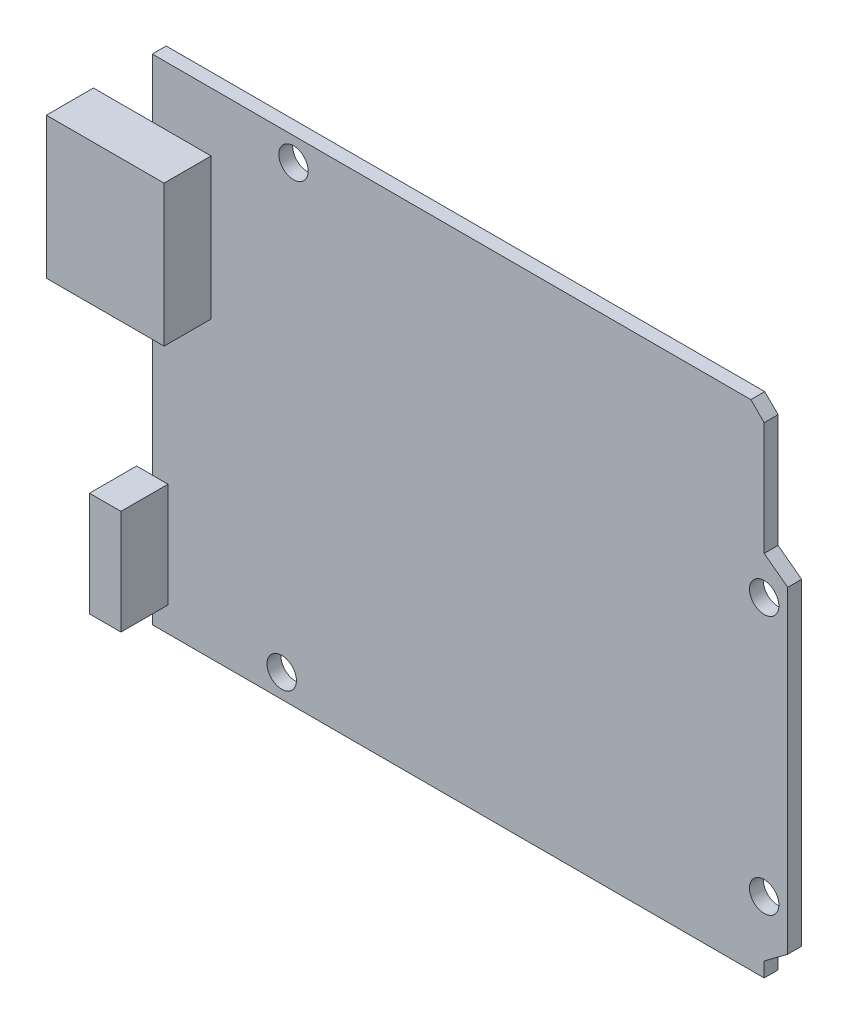
ISO-10303-21;
HEADER;
FILE_DESCRIPTION(('STEP AP214'),'2;1');
FILE_NAME('part.step','',(''),(''),'','','');
FILE_SCHEMA(('AUTOMOTIVE_DESIGN { 1 0 10303 214 1 1 1 1 }'));
ENDSEC;
DATA;
#1=APPLICATION_CONTEXT('core data for automotive mechanical design processes');
#2=APPLICATION_PROTOCOL_DEFINITION('international standard','automotive_design',2000,#1);
#3=PRODUCT_CONTEXT('',#1,'mechanical');
#4=PRODUCT('Part','Part','',(#3));
#5=PRODUCT_RELATED_PRODUCT_CATEGORY('part','',(#4));
#6=PRODUCT_DEFINITION_FORMATION('','',#4);
#7=PRODUCT_DEFINITION_CONTEXT('part definition',#1,'design');
#8=PRODUCT_DEFINITION('design','',#6,#7);
#9=PRODUCT_DEFINITION_SHAPE('','',#8);
#10=(LENGTH_UNIT() NAMED_UNIT(*) SI_UNIT(.MILLI.,.METRE.));
#11=(NAMED_UNIT(*) PLANE_ANGLE_UNIT() SI_UNIT($,.RADIAN.));
#12=(NAMED_UNIT(*) SI_UNIT($,.STERADIAN.) SOLID_ANGLE_UNIT());
#13=UNCERTAINTY_MEASURE_WITH_UNIT(LENGTH_MEASURE(1.E-05),#10,'distance_accuracy_value','');
#14=(GEOMETRIC_REPRESENTATION_CONTEXT(3) GLOBAL_UNCERTAINTY_ASSIGNED_CONTEXT((#13)) GLOBAL_UNIT_ASSIGNED_CONTEXT((#10,
#11,#12)) REPRESENTATION_CONTEXT('',''));
#15=CARTESIAN_POINT('',(0.,0.,0.));
#16=DIRECTION('',(0.,0.,1.));
#17=DIRECTION('',(1.,0.,0.));
#18=AXIS2_PLACEMENT_3D('',#15,#16,#17);
#19=CARTESIAN_POINT('',(0.,0.,1.5));
#20=DIRECTION('',(0.,0.,-1.));
#21=DIRECTION('',(-1.,0.,0.));
#22=AXIS2_PLACEMENT_3D('',#19,#20,#21);
#23=PLANE('',#22);
#24=CARTESIAN_POINT('',(-19.05,24.13,1.5));
#25=DIRECTION('',(0.,0.,1.));
#26=DIRECTION('',(1.,0.,0.));
#27=AXIS2_PLACEMENT_3D('',#24,#25,#26);
#28=CIRCLE('',#27,1.5875);
#29=CARTESIAN_POINT('',(-17.4625,24.13,1.5));
#30=VERTEX_POINT('',#29);
#31=EDGE_CURVE('E214',#30,#30,#28,.T.);
#32=ORIENTED_EDGE('',*,*,#31,.F.);
#33=EDGE_LOOP('',(#32));
#34=FACE_BOUND('',#33,.T.);
#35=CARTESIAN_POINT('',(31.75,-19.05,1.5));
#36=DIRECTION('',(0.,0.,1.));
#37=DIRECTION('',(1.,0.,0.));
#38=AXIS2_PLACEMENT_3D('',#35,#36,#37);
#39=CIRCLE('',#38,1.5875);
#40=CARTESIAN_POINT('',(33.3375,-19.05,1.5));
#41=VERTEX_POINT('',#40);
#42=EDGE_CURVE('E317',#41,#41,#39,.T.);
#43=ORIENTED_EDGE('',*,*,#42,.F.);
#44=EDGE_LOOP('',(#43));
#45=FACE_BOUND('',#44,.T.);
#46=CARTESIAN_POINT('',(31.75,8.89,1.5));
#47=DIRECTION('',(0.,0.,1.));
#48=DIRECTION('',(1.,0.,0.));
#49=AXIS2_PLACEMENT_3D('',#46,#47,#48);
#50=CIRCLE('',#49,1.5875);
#51=CARTESIAN_POINT('',(33.3375,8.89,1.5));
#52=VERTEX_POINT('',#51);
#53=EDGE_CURVE('E320',#52,#52,#50,.T.);
#54=ORIENTED_EDGE('',*,*,#53,.F.);
#55=EDGE_LOOP('',(#54));
#56=FACE_BOUND('',#55,.T.);
#57=CARTESIAN_POINT('',(-20.32,-24.13,1.5));
#58=DIRECTION('',(0.,0.,1.));
#59=DIRECTION('',(1.,0.,0.));
#60=AXIS2_PLACEMENT_3D('',#57,#58,#59);
#61=CIRCLE('',#60,1.5875);
#62=CARTESIAN_POINT('',(-18.7325,-24.13,1.5));
#63=VERTEX_POINT('',#62);
#64=EDGE_CURVE('E316',#63,#63,#61,.T.);
#65=ORIENTED_EDGE('',*,*,#64,.F.);
#66=EDGE_LOOP('',(#65));
#67=FACE_BOUND('',#66,.T.);
#68=DIRECTION('',(0.,1.,0.));
#69=VECTOR('',#68,1.);
#70=CARTESIAN_POINT('',(34.29,-26.67,1.5));
#71=LINE('',#70,#69);
#72=CARTESIAN_POINT('',(34.29,-23.1815470961268,1.5));
#73=VERTEX_POINT('',#72);
#74=CARTESIAN_POINT('',(34.29,11.1157964472055,1.5));
#75=VERTEX_POINT('',#74);
#76=EDGE_CURVE('E204',#73,#75,#71,.T.);
#77=ORIENTED_EDGE('',*,*,#76,.T.);
#78=DIRECTION('',(0.801223892096283,-0.598364667016765,0.));
#79=VECTOR('',#78,1.);
#80=CARTESIAN_POINT('',(31.75,13.0127022549518,1.5));
#81=LINE('',#80,#79);
#82=CARTESIAN_POINT('',(31.75,13.0127022549518,1.5));
#83=VERTEX_POINT('',#82);
#84=EDGE_CURVE('E176',#83,#75,#81,.T.);
#85=ORIENTED_EDGE('',*,*,#84,.F.);
#86=DIRECTION('',(0.,-1.,0.));
#87=VECTOR('',#86,1.);
#88=CARTESIAN_POINT('',(31.75,13.0127022549518,1.5));
#89=LINE('',#88,#87);
#90=CARTESIAN_POINT('',(31.75,25.2331590206289,1.5));
#91=VERTEX_POINT('',#90);
#92=EDGE_CURVE('E306',#91,#83,#89,.T.);
#93=ORIENTED_EDGE('',*,*,#92,.F.);
#94=DIRECTION('',(0.707106781186552,-0.707106781186543,0.));
#95=VECTOR('',#94,1.);
#96=CARTESIAN_POINT('',(30.3131590206289,26.67,1.5));
#97=LINE('',#96,#95);
#98=CARTESIAN_POINT('',(30.3131590206289,26.67,1.5));
#99=VERTEX_POINT('',#98);
#100=EDGE_CURVE('E303',#99,#91,#97,.T.);
#101=ORIENTED_EDGE('',*,*,#100,.F.);
#102=DIRECTION('',(-1.,0.,0.));
#103=VECTOR('',#102,1.);
#104=CARTESIAN_POINT('',(-34.29,26.67,1.5));
#105=LINE('',#104,#103);
#106=CARTESIAN_POINT('',(-34.29,26.67,1.5));
#107=VERTEX_POINT('',#106);
#108=EDGE_CURVE('E184',#99,#107,#105,.T.);
#109=ORIENTED_EDGE('',*,*,#108,.T.);
#110=DIRECTION('',(0.,-1.,0.));
#111=VECTOR('',#110,1.);
#112=CARTESIAN_POINT('',(-34.29,-26.67,1.5));
#113=LINE('',#112,#111);
#114=CARTESIAN_POINT('',(-34.29,20.32,1.5));
#115=VERTEX_POINT('',#114);
#116=EDGE_CURVE('E289',#107,#115,#113,.T.);
#117=ORIENTED_EDGE('',*,*,#116,.T.);
#118=DIRECTION('',(-1.,0.,0.));
#119=VECTOR('',#118,1.);
#120=CARTESIAN_POINT('',(-40.64,20.32,1.5));
#121=LINE('',#120,#119);
#122=CARTESIAN_POINT('',(-27.94,20.32,1.5));
#123=VERTEX_POINT('',#122);
#124=EDGE_CURVE('E269',#123,#115,#121,.T.);
#125=ORIENTED_EDGE('',*,*,#124,.F.);
#126=DIRECTION('',(0.,1.,0.));
#127=VECTOR('',#126,1.);
#128=CARTESIAN_POINT('',(-27.94,5.08,1.5));
#129=LINE('',#128,#127);
#130=CARTESIAN_POINT('',(-27.94,5.08,1.5));
#131=VERTEX_POINT('',#130);
#132=EDGE_CURVE('E255',#131,#123,#129,.T.);
#133=ORIENTED_EDGE('',*,*,#132,.F.);
#134=DIRECTION('',(1.,0.,0.));
#135=VECTOR('',#134,1.);
#136=CARTESIAN_POINT('',(-40.64,5.08,1.5));
#137=LINE('',#136,#135);
#138=CARTESIAN_POINT('',(-34.29,5.08,1.5));
#139=VERTEX_POINT('',#138);
#140=EDGE_CURVE('E11',#139,#131,#137,.T.);
#141=ORIENTED_EDGE('',*,*,#140,.F.);
#142=CARTESIAN_POINT('',(-34.29,-12.6860049869124,1.5));
#143=VERTEX_POINT('',#142);
#144=EDGE_CURVE('E356',#139,#143,#113,.T.);
#145=ORIENTED_EDGE('',*,*,#144,.T.);
#146=DIRECTION('',(-1.,0.,0.));
#147=VECTOR('',#146,1.);
#148=CARTESIAN_POINT('',(-35.9875181952427,-12.6860049869124,1.5));
#149=LINE('',#148,#147);
#150=CARTESIAN_POINT('',(-32.5924818047572,-12.6860049869124,1.5));
#151=VERTEX_POINT('',#150);
#152=EDGE_CURVE('E230',#151,#143,#149,.T.);
#153=ORIENTED_EDGE('',*,*,#152,.F.);
#154=DIRECTION('',(0.,1.,0.));
#155=VECTOR('',#154,1.);
#156=CARTESIAN_POINT('',(-32.5924818047572,-23.9715545871231,1.5));
#157=LINE('',#156,#155);
#158=CARTESIAN_POINT('',(-32.5924818047572,-23.9715545871231,1.5));
#159=VERTEX_POINT('',#158);
#160=EDGE_CURVE('E221',#159,#151,#157,.T.);
#161=ORIENTED_EDGE('',*,*,#160,.F.);
#162=DIRECTION('',(1.,0.,0.));
#163=VECTOR('',#162,1.);
#164=CARTESIAN_POINT('',(-35.9875181952427,-23.9715545871231,1.5));
#165=LINE('',#164,#163);
#166=CARTESIAN_POINT('',(-34.29,-23.9715545871231,1.5));
#167=VERTEX_POINT('',#166);
#168=EDGE_CURVE('E239',#167,#159,#165,.T.);
#169=ORIENTED_EDGE('',*,*,#168,.F.);
#170=CARTESIAN_POINT('',(-34.29,-26.67,1.5));
#171=VERTEX_POINT('',#170);
#172=EDGE_CURVE('E288',#167,#171,#113,.T.);
#173=ORIENTED_EDGE('',*,*,#172,.T.);
#174=DIRECTION('',(1.,0.,0.));
#175=VECTOR('',#174,1.);
#176=CARTESIAN_POINT('',(-34.29,-26.67,1.5));
#177=LINE('',#176,#175);
#178=CARTESIAN_POINT('',(31.75,-26.67,1.5));
#179=VERTEX_POINT('',#178);
#180=EDGE_CURVE('E208',#171,#179,#177,.T.);
#181=ORIENTED_EDGE('',*,*,#180,.T.);
#182=DIRECTION('',(0.,-1.,0.));
#183=VECTOR('',#182,1.);
#184=CARTESIAN_POINT('',(31.75,-25.0784529038732,1.5));
#185=LINE('',#184,#183);
#186=CARTESIAN_POINT('',(31.75,-25.0784529038732,1.5));
#187=VERTEX_POINT('',#186);
#188=EDGE_CURVE('E296',#187,#179,#185,.T.);
#189=ORIENTED_EDGE('',*,*,#188,.F.);
#190=DIRECTION('',(-0.801223892096282,-0.598364667016766,0.));
#191=VECTOR('',#190,1.);
#192=CARTESIAN_POINT('',(34.29,-23.1815470961268,1.5));
#193=LINE('',#192,#191);
#194=EDGE_CURVE('E617',#73,#187,#193,.T.);
#195=ORIENTED_EDGE('',*,*,#194,.F.);
#196=EDGE_LOOP('',(#77,#85,#93,#101,#109,#117,#125,#133,#141,#145,#153,#161,#169,#173,#181,#189,#195));
#197=FACE_BOUND('',#196,.T.);
#198=ADVANCED_FACE('F34',(#34,#45,#56,#67,#197),#23,.F.);
#199=CARTESIAN_POINT('',(34.29,-26.67,1.5));
#200=DIRECTION('',(-1.,0.,0.));
#201=DIRECTION('',(0.,0.,1.));
#202=AXIS2_PLACEMENT_3D('',#199,#200,#201);
#203=PLANE('',#202);
#204=DIRECTION('',(0.,1.,0.));
#205=VECTOR('',#204,1.);
#206=CARTESIAN_POINT('',(34.29,-26.67,0.));
#207=LINE('',#206,#205);
#208=CARTESIAN_POINT('',(34.29,-23.1815470961268,0.));
#209=VERTEX_POINT('',#208);
#210=CARTESIAN_POINT('',(34.29,11.1157964472055,0.));
#211=VERTEX_POINT('',#210);
#212=EDGE_CURVE('E193',#209,#211,#207,.T.);
#213=ORIENTED_EDGE('',*,*,#212,.T.);
#214=DIRECTION('',(0.,0.,1.));
#215=VECTOR('',#214,1.);
#216=CARTESIAN_POINT('',(34.29,11.1157964472055,0.));
#217=LINE('',#216,#215);
#218=EDGE_CURVE('E321',#211,#75,#217,.T.);
#219=ORIENTED_EDGE('',*,*,#218,.T.);
#220=ORIENTED_EDGE('',*,*,#76,.F.);
#221=DIRECTION('',(0.,0.,1.));
#222=VECTOR('',#221,1.);
#223=CARTESIAN_POINT('',(34.29,-23.1815470961268,0.));
#224=LINE('',#223,#222);
#225=EDGE_CURVE('E308',#209,#73,#224,.T.);
#226=ORIENTED_EDGE('',*,*,#225,.F.);
#227=EDGE_LOOP('',(#213,#219,#220,#226));
#228=FACE_BOUND('',#227,.T.);
#229=ADVANCED_FACE('F36',(#228),#203,.F.);
#230=CARTESIAN_POINT('',(-34.29,26.67,1.5));
#231=DIRECTION('',(0.,-1.,0.));
#232=DIRECTION('',(0.,0.,-1.));
#233=AXIS2_PLACEMENT_3D('',#230,#231,#232);
#234=PLANE('',#233);
#235=ORIENTED_EDGE('',*,*,#108,.F.);
#236=DIRECTION('',(0.,0.,1.));
#237=VECTOR('',#236,1.);
#238=CARTESIAN_POINT('',(30.3131590206289,26.67,0.));
#239=LINE('',#238,#237);
#240=CARTESIAN_POINT('',(30.3131590206289,26.67,0.));
#241=VERTEX_POINT('',#240);
#242=EDGE_CURVE('E171',#241,#99,#239,.T.);
#243=ORIENTED_EDGE('',*,*,#242,.F.);
#244=DIRECTION('',(-1.,0.,0.));
#245=VECTOR('',#244,1.);
#246=CARTESIAN_POINT('',(-34.29,26.67,0.));
#247=LINE('',#246,#245);
#248=CARTESIAN_POINT('',(-34.29,26.67,0.));
#249=VERTEX_POINT('',#248);
#250=EDGE_CURVE('E182',#241,#249,#247,.T.);
#251=ORIENTED_EDGE('',*,*,#250,.T.);
#252=DIRECTION('',(0.,0.,-1.));
#253=VECTOR('',#252,1.);
#254=CARTESIAN_POINT('',(-34.29,26.67,1.5));
#255=LINE('',#254,#253);
#256=EDGE_CURVE('E43',#107,#249,#255,.T.);
#257=ORIENTED_EDGE('',*,*,#256,.F.);
#258=EDGE_LOOP('',(#235,#243,#251,#257));
#259=FACE_BOUND('',#258,.T.);
#260=ADVANCED_FACE('F180',(#259),#234,.F.);
#261=CARTESIAN_POINT('',(-34.29,-26.67,1.5));
#262=DIRECTION('',(1.,0.,0.));
#263=DIRECTION('',(0.,0.,-1.));
#264=AXIS2_PLACEMENT_3D('',#261,#262,#263);
#265=PLANE('',#264);
#266=DIRECTION('',(0.,-1.,0.));
#267=VECTOR('',#266,1.);
#268=CARTESIAN_POINT('',(-34.29,-26.67,0.));
#269=LINE('',#268,#267);
#270=CARTESIAN_POINT('',(-34.29,-26.67,0.));
#271=VERTEX_POINT('',#270);
#272=EDGE_CURVE('E192',#249,#271,#269,.T.);
#273=ORIENTED_EDGE('',*,*,#272,.T.);
#274=DIRECTION('',(0.,0.,-1.));
#275=VECTOR('',#274,1.);
#276=CARTESIAN_POINT('',(-34.29,-26.67,1.5));
#277=LINE('',#276,#275);
#278=EDGE_CURVE('E205',#171,#271,#277,.T.);
#279=ORIENTED_EDGE('',*,*,#278,.F.);
#280=ORIENTED_EDGE('',*,*,#172,.F.);
#281=EDGE_CURVE('E352',#143,#167,#113,.T.);
#282=ORIENTED_EDGE('',*,*,#281,.F.);
#283=ORIENTED_EDGE('',*,*,#144,.F.);
#284=EDGE_CURVE('E290',#115,#139,#113,.T.);
#285=ORIENTED_EDGE('',*,*,#284,.F.);
#286=ORIENTED_EDGE('',*,*,#116,.F.);
#287=ORIENTED_EDGE('',*,*,#256,.T.);
#288=EDGE_LOOP('',(#273,#279,#280,#282,#283,#285,#286,#287));
#289=FACE_BOUND('',#288,.T.);
#290=ADVANCED_FACE('F377',(#289),#265,.F.);
#291=CARTESIAN_POINT('',(-34.29,-26.67,1.5));
#292=DIRECTION('',(0.,1.,0.));
#293=DIRECTION('',(0.,0.,1.));
#294=AXIS2_PLACEMENT_3D('',#291,#292,#293);
#295=PLANE('',#294);
#296=DIRECTION('',(1.,0.,0.));
#297=VECTOR('',#296,1.);
#298=CARTESIAN_POINT('',(-34.29,-26.67,0.));
#299=LINE('',#298,#297);
#300=CARTESIAN_POINT('',(31.75,-26.67,0.));
#301=VERTEX_POINT('',#300);
#302=EDGE_CURVE('E195',#271,#301,#299,.T.);
#303=ORIENTED_EDGE('',*,*,#302,.T.);
#304=DIRECTION('',(0.,0.,1.));
#305=VECTOR('',#304,1.);
#306=CARTESIAN_POINT('',(31.75,-26.67,0.));
#307=LINE('',#306,#305);
#308=EDGE_CURVE('E302',#301,#179,#307,.T.);
#309=ORIENTED_EDGE('',*,*,#308,.T.);
#310=ORIENTED_EDGE('',*,*,#180,.F.);
#311=ORIENTED_EDGE('',*,*,#278,.T.);
#312=EDGE_LOOP('',(#303,#309,#310,#311));
#313=FACE_BOUND('',#312,.T.);
#314=ADVANCED_FACE('F301',(#313),#295,.F.);
#315=CARTESIAN_POINT('',(0.,0.,0.));
#316=DIRECTION('',(0.,0.,-1.));
#317=DIRECTION('',(-1.,0.,0.));
#318=AXIS2_PLACEMENT_3D('',#315,#316,#317);
#319=PLANE('',#318);
#320=DIRECTION('',(0.801223892096283,-0.598364667016765,0.));
#321=VECTOR('',#320,1.);
#322=CARTESIAN_POINT('',(31.75,13.0127022549518,0.));
#323=LINE('',#322,#321);
#324=CARTESIAN_POINT('',(31.75,13.0127022549518,0.));
#325=VERTEX_POINT('',#324);
#326=EDGE_CURVE('E185',#325,#211,#323,.T.);
#327=ORIENTED_EDGE('',*,*,#326,.T.);
#328=ORIENTED_EDGE('',*,*,#212,.F.);
#329=DIRECTION('',(-0.801223892096282,-0.598364667016766,0.));
#330=VECTOR('',#329,1.);
#331=CARTESIAN_POINT('',(34.29,-23.1815470961268,0.));
#332=LINE('',#331,#330);
#333=CARTESIAN_POINT('',(31.75,-25.0784529038732,0.));
#334=VERTEX_POINT('',#333);
#335=EDGE_CURVE('E614',#209,#334,#332,.T.);
#336=ORIENTED_EDGE('',*,*,#335,.T.);
#337=DIRECTION('',(0.,-1.,0.));
#338=VECTOR('',#337,1.);
#339=CARTESIAN_POINT('',(31.75,-25.0784529038732,0.));
#340=LINE('',#339,#338);
#341=EDGE_CURVE('E60',#334,#301,#340,.T.);
#342=ORIENTED_EDGE('',*,*,#341,.T.);
#343=ORIENTED_EDGE('',*,*,#302,.F.);
#344=ORIENTED_EDGE('',*,*,#272,.F.);
#345=ORIENTED_EDGE('',*,*,#250,.F.);
#346=DIRECTION('',(0.707106781186552,-0.707106781186543,0.));
#347=VECTOR('',#346,1.);
#348=CARTESIAN_POINT('',(30.3131590206289,26.67,0.));
#349=LINE('',#348,#347);
#350=CARTESIAN_POINT('',(31.75,25.2331590206289,0.));
#351=VERTEX_POINT('',#350);
#352=EDGE_CURVE('E167',#241,#351,#349,.T.);
#353=ORIENTED_EDGE('',*,*,#352,.T.);
#354=DIRECTION('',(0.,-1.,0.));
#355=VECTOR('',#354,1.);
#356=CARTESIAN_POINT('',(31.75,13.0127022549518,0.));
#357=LINE('',#356,#355);
#358=EDGE_CURVE('E52',#351,#325,#357,.T.);
#359=ORIENTED_EDGE('',*,*,#358,.T.);
#360=EDGE_LOOP('',(#327,#328,#336,#342,#343,#344,#345,#353,#359));
#361=FACE_BOUND('',#360,.T.);
#362=CARTESIAN_POINT('',(-19.05,24.13,0.));
#363=DIRECTION('',(0.,0.,-1.));
#364=DIRECTION('',(-1.,0.,0.));
#365=AXIS2_PLACEMENT_3D('',#362,#363,#364);
#366=CIRCLE('',#365,1.5875);
#367=CARTESIAN_POINT('',(-20.6375,24.13,0.));
#368=VERTEX_POINT('',#367);
#369=EDGE_CURVE('E38',#368,#368,#366,.T.);
#370=ORIENTED_EDGE('',*,*,#369,.F.);
#371=EDGE_LOOP('',(#370));
#372=FACE_BOUND('',#371,.T.);
#373=CARTESIAN_POINT('',(31.75,-19.05,0.));
#374=DIRECTION('',(0.,0.,-1.));
#375=DIRECTION('',(-1.,0.,0.));
#376=AXIS2_PLACEMENT_3D('',#373,#374,#375);
#377=CIRCLE('',#376,1.5875);
#378=CARTESIAN_POINT('',(30.1625,-19.05,0.));
#379=VERTEX_POINT('',#378);
#380=EDGE_CURVE('E216',#379,#379,#377,.T.);
#381=ORIENTED_EDGE('',*,*,#380,.F.);
#382=EDGE_LOOP('',(#381));
#383=FACE_BOUND('',#382,.T.);
#384=CARTESIAN_POINT('',(31.75,8.89,0.));
#385=DIRECTION('',(0.,0.,-1.));
#386=DIRECTION('',(-1.,0.,0.));
#387=AXIS2_PLACEMENT_3D('',#384,#385,#386);
#388=CIRCLE('',#387,1.5875);
#389=CARTESIAN_POINT('',(30.1625,8.89,0.));
#390=VERTEX_POINT('',#389);
#391=EDGE_CURVE('E213',#390,#390,#388,.T.);
#392=ORIENTED_EDGE('',*,*,#391,.F.);
#393=EDGE_LOOP('',(#392));
#394=FACE_BOUND('',#393,.T.);
#395=CARTESIAN_POINT('',(-20.32,-24.13,0.));
#396=DIRECTION('',(0.,0.,-1.));
#397=DIRECTION('',(-1.,0.,0.));
#398=AXIS2_PLACEMENT_3D('',#395,#396,#397);
#399=CIRCLE('',#398,1.5875);
#400=CARTESIAN_POINT('',(-21.9075,-24.13,0.));
#401=VERTEX_POINT('',#400);
#402=EDGE_CURVE('E210',#401,#401,#399,.T.);
#403=ORIENTED_EDGE('',*,*,#402,.F.);
#404=EDGE_LOOP('',(#403));
#405=FACE_BOUND('',#404,.T.);
#406=ADVANCED_FACE('F189',(#361,#372,#383,#394,#405),#319,.T.);
#407=CARTESIAN_POINT('',(-27.94,5.08,6.58));
#408=DIRECTION('',(-1.,0.,0.));
#409=DIRECTION('',(0.,0.,1.));
#410=AXIS2_PLACEMENT_3D('',#407,#408,#409);
#411=PLANE('',#410);
#412=ORIENTED_EDGE('',*,*,#132,.T.);
#413=DIRECTION('',(0.,0.,-1.));
#414=VECTOR('',#413,1.);
#415=CARTESIAN_POINT('',(-27.94,20.32,6.58));
#416=LINE('',#415,#414);
#417=CARTESIAN_POINT('',(-27.94,20.32,6.58));
#418=VERTEX_POINT('',#417);
#419=EDGE_CURVE('E198',#418,#123,#416,.T.);
#420=ORIENTED_EDGE('',*,*,#419,.F.);
#421=DIRECTION('',(0.,1.,0.));
#422=VECTOR('',#421,1.);
#423=CARTESIAN_POINT('',(-27.94,5.08,6.58));
#424=LINE('',#423,#422);
#425=CARTESIAN_POINT('',(-27.94,5.08,6.58));
#426=VERTEX_POINT('',#425);
#427=EDGE_CURVE('E256',#426,#418,#424,.T.);
#428=ORIENTED_EDGE('',*,*,#427,.F.);
#429=DIRECTION('',(0.,0.,-1.));
#430=VECTOR('',#429,1.);
#431=CARTESIAN_POINT('',(-27.94,5.08,6.58));
#432=LINE('',#431,#430);
#433=EDGE_CURVE('E265',#426,#131,#432,.T.);
#434=ORIENTED_EDGE('',*,*,#433,.T.);
#435=EDGE_LOOP('',(#412,#420,#428,#434));
#436=FACE_BOUND('',#435,.T.);
#437=ADVANCED_FACE('F396',(#436),#411,.F.);
#438=CARTESIAN_POINT('',(-40.64,20.32,6.58));
#439=DIRECTION('',(0.,-1.,0.));
#440=DIRECTION('',(0.,0.,-1.));
#441=AXIS2_PLACEMENT_3D('',#438,#439,#440);
#442=PLANE('',#441);
#443=ORIENTED_EDGE('',*,*,#124,.T.);
#444=CARTESIAN_POINT('',(-40.64,20.32,1.5));
#445=VERTEX_POINT('',#444);
#446=EDGE_CURVE('E268',#115,#445,#121,.T.);
#447=ORIENTED_EDGE('',*,*,#446,.T.);
#448=DIRECTION('',(0.,0.,-1.));
#449=VECTOR('',#448,1.);
#450=CARTESIAN_POINT('',(-40.64,20.32,6.58));
#451=LINE('',#450,#449);
#452=CARTESIAN_POINT('',(-40.64,20.32,6.58));
#453=VERTEX_POINT('',#452);
#454=EDGE_CURVE('E280',#453,#445,#451,.T.);
#455=ORIENTED_EDGE('',*,*,#454,.F.);
#456=DIRECTION('',(-1.,0.,0.));
#457=VECTOR('',#456,1.);
#458=CARTESIAN_POINT('',(-40.64,20.32,6.58));
#459=LINE('',#458,#457);
#460=EDGE_CURVE('E259',#418,#453,#459,.T.);
#461=ORIENTED_EDGE('',*,*,#460,.F.);
#462=ORIENTED_EDGE('',*,*,#419,.T.);
#463=EDGE_LOOP('',(#443,#447,#455,#461,#462));
#464=FACE_BOUND('',#463,.T.);
#465=ADVANCED_FACE('F375',(#464),#442,.F.);
#466=CARTESIAN_POINT('',(-40.64,5.08,6.58));
#467=DIRECTION('',(1.,0.,0.));
#468=DIRECTION('',(0.,0.,-1.));
#469=AXIS2_PLACEMENT_3D('',#466,#467,#468);
#470=PLANE('',#469);
#471=DIRECTION('',(0.,-1.,0.));
#472=VECTOR('',#471,1.);
#473=CARTESIAN_POINT('',(-40.64,5.08,1.5));
#474=LINE('',#473,#472);
#475=CARTESIAN_POINT('',(-40.64,5.08,1.5));
#476=VERTEX_POINT('',#475);
#477=EDGE_CURVE('E272',#445,#476,#474,.T.);
#478=ORIENTED_EDGE('',*,*,#477,.T.);
#479=DIRECTION('',(0.,0.,-1.));
#480=VECTOR('',#479,1.);
#481=CARTESIAN_POINT('',(-40.64,5.08,6.58));
#482=LINE('',#481,#480);
#483=CARTESIAN_POINT('',(-40.64,5.08,6.58));
#484=VERTEX_POINT('',#483);
#485=EDGE_CURVE('E277',#484,#476,#482,.T.);
#486=ORIENTED_EDGE('',*,*,#485,.F.);
#487=DIRECTION('',(0.,-1.,0.));
#488=VECTOR('',#487,1.);
#489=CARTESIAN_POINT('',(-40.64,5.08,6.58));
#490=LINE('',#489,#488);
#491=EDGE_CURVE('E261',#453,#484,#490,.T.);
#492=ORIENTED_EDGE('',*,*,#491,.F.);
#493=ORIENTED_EDGE('',*,*,#454,.T.);
#494=EDGE_LOOP('',(#478,#486,#492,#493));
#495=FACE_BOUND('',#494,.T.);
#496=ADVANCED_FACE('F372',(#495),#470,.F.);
#497=CARTESIAN_POINT('',(-40.64,5.08,6.58));
#498=DIRECTION('',(0.,1.,0.));
#499=DIRECTION('',(0.,0.,1.));
#500=AXIS2_PLACEMENT_3D('',#497,#498,#499);
#501=PLANE('',#500);
#502=EDGE_CURVE('E45',#476,#139,#137,.T.);
#503=ORIENTED_EDGE('',*,*,#502,.T.);
#504=ORIENTED_EDGE('',*,*,#140,.T.);
#505=ORIENTED_EDGE('',*,*,#433,.F.);
#506=DIRECTION('',(1.,0.,0.));
#507=VECTOR('',#506,1.);
#508=CARTESIAN_POINT('',(-40.64,5.08,6.58));
#509=LINE('',#508,#507);
#510=EDGE_CURVE('E263',#484,#426,#509,.T.);
#511=ORIENTED_EDGE('',*,*,#510,.F.);
#512=ORIENTED_EDGE('',*,*,#485,.T.);
#513=EDGE_LOOP('',(#503,#504,#505,#511,#512));
#514=FACE_BOUND('',#513,.T.);
#515=ADVANCED_FACE('F366',(#514),#501,.F.);
#516=CARTESIAN_POINT('',(0.,0.,6.58));
#517=DIRECTION('',(0.,0.,-1.));
#518=DIRECTION('',(-1.,0.,0.));
#519=AXIS2_PLACEMENT_3D('',#516,#517,#518);
#520=PLANE('',#519);
#521=ORIENTED_EDGE('',*,*,#427,.T.);
#522=ORIENTED_EDGE('',*,*,#460,.T.);
#523=ORIENTED_EDGE('',*,*,#491,.T.);
#524=ORIENTED_EDGE('',*,*,#510,.T.);
#525=EDGE_LOOP('',(#521,#522,#523,#524));
#526=FACE_BOUND('',#525,.T.);
#527=ADVANCED_FACE('F408',(#526),#520,.F.);
#528=CARTESIAN_POINT('',(0.,0.,1.5));
#529=DIRECTION('',(0.,0.,-1.));
#530=DIRECTION('',(-1.,0.,0.));
#531=AXIS2_PLACEMENT_3D('',#528,#529,#530);
#532=PLANE('',#531);
#533=ORIENTED_EDGE('',*,*,#446,.F.);
#534=ORIENTED_EDGE('',*,*,#284,.T.);
#535=ORIENTED_EDGE('',*,*,#502,.F.);
#536=ORIENTED_EDGE('',*,*,#477,.F.);
#537=EDGE_LOOP('',(#533,#534,#535,#536));
#538=FACE_BOUND('',#537,.T.);
#539=ADVANCED_FACE('F362',(#538),#532,.T.);
#540=CARTESIAN_POINT('',(0.,0.,1.5));
#541=DIRECTION('',(0.,0.,-1.));
#542=DIRECTION('',(-1.,0.,0.));
#543=AXIS2_PLACEMENT_3D('',#540,#541,#542);
#544=PLANE('',#543);
#545=ORIENTED_EDGE('',*,*,#281,.T.);
#546=CARTESIAN_POINT('',(-35.9875181952427,-23.9715545871231,1.5));
#547=VERTEX_POINT('',#546);
#548=EDGE_CURVE('E240',#547,#167,#165,.T.);
#549=ORIENTED_EDGE('',*,*,#548,.F.);
#550=DIRECTION('',(0.,-1.,0.));
#551=VECTOR('',#550,1.);
#552=CARTESIAN_POINT('',(-35.9875181952427,-23.9715545871231,1.5));
#553=LINE('',#552,#551);
#554=CARTESIAN_POINT('',(-35.9875181952427,-12.6860049869124,1.5));
#555=VERTEX_POINT('',#554);
#556=EDGE_CURVE('E237',#555,#547,#553,.T.);
#557=ORIENTED_EDGE('',*,*,#556,.F.);
#558=EDGE_CURVE('E225',#143,#555,#149,.T.);
#559=ORIENTED_EDGE('',*,*,#558,.F.);
#560=EDGE_LOOP('',(#545,#549,#557,#559));
#561=FACE_BOUND('',#560,.T.);
#562=ADVANCED_FACE('F351',(#561),#544,.T.);
#563=CARTESIAN_POINT('',(-32.5924818047572,-23.9715545871231,6.58));
#564=DIRECTION('',(-1.,0.,0.));
#565=DIRECTION('',(0.,0.,1.));
#566=AXIS2_PLACEMENT_3D('',#563,#564,#565);
#567=PLANE('',#566);
#568=ORIENTED_EDGE('',*,*,#160,.T.);
#569=DIRECTION('',(0.,0.,-1.));
#570=VECTOR('',#569,1.);
#571=CARTESIAN_POINT('',(-32.5924818047572,-12.6860049869124,6.58));
#572=LINE('',#571,#570);
#573=CARTESIAN_POINT('',(-32.5924818047572,-12.6860049869124,6.58));
#574=VERTEX_POINT('',#573);
#575=EDGE_CURVE('E252',#574,#151,#572,.T.);
#576=ORIENTED_EDGE('',*,*,#575,.F.);
#577=DIRECTION('',(0.,1.,0.));
#578=VECTOR('',#577,1.);
#579=CARTESIAN_POINT('',(-32.5924818047572,-23.9715545871231,6.58));
#580=LINE('',#579,#578);
#581=CARTESIAN_POINT('',(-32.5924818047572,-23.9715545871231,6.58));
#582=VERTEX_POINT('',#581);
#583=EDGE_CURVE('E243',#582,#574,#580,.T.);
#584=ORIENTED_EDGE('',*,*,#583,.F.);
#585=DIRECTION('',(0.,0.,-1.));
#586=VECTOR('',#585,1.);
#587=CARTESIAN_POINT('',(-32.5924818047572,-23.9715545871231,6.58));
#588=LINE('',#587,#586);
#589=EDGE_CURVE('E244',#582,#159,#588,.T.);
#590=ORIENTED_EDGE('',*,*,#589,.T.);
#591=EDGE_LOOP('',(#568,#576,#584,#590));
#592=FACE_BOUND('',#591,.T.);
#593=ADVANCED_FACE('F340',(#592),#567,.F.);
#594=CARTESIAN_POINT('',(-35.9875181952427,-12.6860049869124,6.58));
#595=DIRECTION('',(0.,-1.,0.));
#596=DIRECTION('',(0.,0.,-1.));
#597=AXIS2_PLACEMENT_3D('',#594,#595,#596);
#598=PLANE('',#597);
#599=ORIENTED_EDGE('',*,*,#152,.T.);
#600=ORIENTED_EDGE('',*,*,#558,.T.);
#601=DIRECTION('',(0.,0.,-1.));
#602=VECTOR('',#601,1.);
#603=CARTESIAN_POINT('',(-35.9875181952427,-12.6860049869124,6.58));
#604=LINE('',#603,#602);
#605=CARTESIAN_POINT('',(-35.9875181952427,-12.6860049869124,6.58));
#606=VERTEX_POINT('',#605);
#607=EDGE_CURVE('E249',#606,#555,#604,.T.);
#608=ORIENTED_EDGE('',*,*,#607,.F.);
#609=DIRECTION('',(-1.,0.,0.));
#610=VECTOR('',#609,1.);
#611=CARTESIAN_POINT('',(-35.9875181952427,-12.6860049869124,6.58));
#612=LINE('',#611,#610);
#613=EDGE_CURVE('E328',#574,#606,#612,.T.);
#614=ORIENTED_EDGE('',*,*,#613,.F.);
#615=ORIENTED_EDGE('',*,*,#575,.T.);
#616=EDGE_LOOP('',(#599,#600,#608,#614,#615));
#617=FACE_BOUND('',#616,.T.);
#618=ADVANCED_FACE('F342',(#617),#598,.F.);
#619=CARTESIAN_POINT('',(-35.9875181952427,-23.9715545871231,6.58));
#620=DIRECTION('',(1.,0.,0.));
#621=DIRECTION('',(0.,0.,-1.));
#622=AXIS2_PLACEMENT_3D('',#619,#620,#621);
#623=PLANE('',#622);
#624=ORIENTED_EDGE('',*,*,#556,.T.);
#625=DIRECTION('',(0.,0.,-1.));
#626=VECTOR('',#625,1.);
#627=CARTESIAN_POINT('',(-35.9875181952427,-23.9715545871231,6.58));
#628=LINE('',#627,#626);
#629=CARTESIAN_POINT('',(-35.9875181952427,-23.9715545871231,6.58));
#630=VERTEX_POINT('',#629);
#631=EDGE_CURVE('E246',#630,#547,#628,.T.);
#632=ORIENTED_EDGE('',*,*,#631,.F.);
#633=DIRECTION('',(0.,-1.,0.));
#634=VECTOR('',#633,1.);
#635=CARTESIAN_POINT('',(-35.9875181952427,-23.9715545871231,6.58));
#636=LINE('',#635,#634);
#637=EDGE_CURVE('E329',#606,#630,#636,.T.);
#638=ORIENTED_EDGE('',*,*,#637,.F.);
#639=ORIENTED_EDGE('',*,*,#607,.T.);
#640=EDGE_LOOP('',(#624,#632,#638,#639));
#641=FACE_BOUND('',#640,.T.);
#642=ADVANCED_FACE('F347',(#641),#623,.F.);
#643=CARTESIAN_POINT('',(-35.9875181952427,-23.9715545871231,6.58));
#644=DIRECTION('',(0.,1.,0.));
#645=DIRECTION('',(0.,0.,1.));
#646=AXIS2_PLACEMENT_3D('',#643,#644,#645);
#647=PLANE('',#646);
#648=ORIENTED_EDGE('',*,*,#548,.T.);
#649=ORIENTED_EDGE('',*,*,#168,.T.);
#650=ORIENTED_EDGE('',*,*,#589,.F.);
#651=DIRECTION('',(1.,0.,0.));
#652=VECTOR('',#651,1.);
#653=CARTESIAN_POINT('',(-35.9875181952427,-23.9715545871231,6.58));
#654=LINE('',#653,#652);
#655=EDGE_CURVE('E233',#630,#582,#654,.T.);
#656=ORIENTED_EDGE('',*,*,#655,.F.);
#657=ORIENTED_EDGE('',*,*,#631,.T.);
#658=EDGE_LOOP('',(#648,#649,#650,#656,#657));
#659=FACE_BOUND('',#658,.T.);
#660=ADVANCED_FACE('F339',(#659),#647,.F.);
#661=CARTESIAN_POINT('',(0.,0.,6.58));
#662=DIRECTION('',(0.,0.,-1.));
#663=DIRECTION('',(-1.,0.,0.));
#664=AXIS2_PLACEMENT_3D('',#661,#662,#663);
#665=PLANE('',#664);
#666=ORIENTED_EDGE('',*,*,#583,.T.);
#667=ORIENTED_EDGE('',*,*,#613,.T.);
#668=ORIENTED_EDGE('',*,*,#637,.T.);
#669=ORIENTED_EDGE('',*,*,#655,.T.);
#670=EDGE_LOOP('',(#666,#667,#668,#669));
#671=FACE_BOUND('',#670,.T.);
#672=ADVANCED_FACE('F335',(#671),#665,.F.);
#673=CARTESIAN_POINT('',(-20.32,-24.13,-8.66));
#674=DIRECTION('',(0.,0.,1.));
#675=DIRECTION('',(1.,0.,0.));
#676=AXIS2_PLACEMENT_3D('',#673,#674,#675);
#677=CYLINDRICAL_SURFACE('',#676,1.5875);
#678=ORIENTED_EDGE('',*,*,#402,.T.);
#679=EDGE_LOOP('',(#678));
#680=FACE_BOUND('',#679,.T.);
#681=ORIENTED_EDGE('',*,*,#64,.T.);
#682=EDGE_LOOP('',(#681));
#683=FACE_BOUND('',#682,.T.);
#684=ADVANCED_FACE('F486',(#680,#683),#677,.F.);
#685=CARTESIAN_POINT('',(31.75,8.89,-8.66));
#686=DIRECTION('',(0.,0.,1.));
#687=DIRECTION('',(1.,0.,0.));
#688=AXIS2_PLACEMENT_3D('',#685,#686,#687);
#689=CYLINDRICAL_SURFACE('',#688,1.5875);
#690=ORIENTED_EDGE('',*,*,#391,.T.);
#691=EDGE_LOOP('',(#690));
#692=FACE_BOUND('',#691,.T.);
#693=ORIENTED_EDGE('',*,*,#53,.T.);
#694=EDGE_LOOP('',(#693));
#695=FACE_BOUND('',#694,.T.);
#696=ADVANCED_FACE('F495',(#692,#695),#689,.F.);
#697=CARTESIAN_POINT('',(31.75,-19.05,-8.66));
#698=DIRECTION('',(0.,0.,1.));
#699=DIRECTION('',(1.,0.,0.));
#700=AXIS2_PLACEMENT_3D('',#697,#698,#699);
#701=CYLINDRICAL_SURFACE('',#700,1.5875);
#702=ORIENTED_EDGE('',*,*,#380,.T.);
#703=EDGE_LOOP('',(#702));
#704=FACE_BOUND('',#703,.T.);
#705=ORIENTED_EDGE('',*,*,#42,.T.);
#706=EDGE_LOOP('',(#705));
#707=FACE_BOUND('',#706,.T.);
#708=ADVANCED_FACE('F505',(#704,#707),#701,.F.);
#709=CARTESIAN_POINT('',(-19.05,24.13,-8.66));
#710=DIRECTION('',(0.,0.,1.));
#711=DIRECTION('',(1.,0.,0.));
#712=AXIS2_PLACEMENT_3D('',#709,#710,#711);
#713=CYLINDRICAL_SURFACE('',#712,1.5875);
#714=ORIENTED_EDGE('',*,*,#369,.T.);
#715=EDGE_LOOP('',(#714));
#716=FACE_BOUND('',#715,.T.);
#717=ORIENTED_EDGE('',*,*,#31,.T.);
#718=EDGE_LOOP('',(#717));
#719=FACE_BOUND('',#718,.T.);
#720=ADVANCED_FACE('F515',(#716,#719),#713,.F.);
#721=CARTESIAN_POINT('',(31.75,-25.0784529038732,0.));
#722=DIRECTION('',(-1.,0.,0.));
#723=DIRECTION('',(0.,0.,1.));
#724=AXIS2_PLACEMENT_3D('',#721,#722,#723);
#725=PLANE('',#724);
#726=ORIENTED_EDGE('',*,*,#188,.T.);
#727=ORIENTED_EDGE('',*,*,#308,.F.);
#728=ORIENTED_EDGE('',*,*,#341,.F.);
#729=DIRECTION('',(0.,0.,1.));
#730=VECTOR('',#729,1.);
#731=CARTESIAN_POINT('',(31.75,-25.0784529038732,0.));
#732=LINE('',#731,#730);
#733=EDGE_CURVE('E304',#334,#187,#732,.T.);
#734=ORIENTED_EDGE('',*,*,#733,.T.);
#735=EDGE_LOOP('',(#726,#727,#728,#734));
#736=FACE_BOUND('',#735,.T.);
#737=ADVANCED_FACE('F523',(#736),#725,.F.);
#738=CARTESIAN_POINT('',(34.29,-23.1815470961268,0.));
#739=DIRECTION('',(-0.598364667016766,0.801223892096282,0.));
#740=DIRECTION('',(-0.801223892096283,-0.598364667016766,0.));
#741=AXIS2_PLACEMENT_3D('',#738,#739,#740);
#742=PLANE('',#741);
#743=ORIENTED_EDGE('',*,*,#194,.T.);
#744=ORIENTED_EDGE('',*,*,#733,.F.);
#745=ORIENTED_EDGE('',*,*,#335,.F.);
#746=ORIENTED_EDGE('',*,*,#225,.T.);
#747=EDGE_LOOP('',(#743,#744,#745,#746));
#748=FACE_BOUND('',#747,.T.);
#749=ADVANCED_FACE('F561',(#748),#742,.F.);
#750=CARTESIAN_POINT('',(31.75,13.0127022549518,0.));
#751=DIRECTION('',(-0.598364667016765,-0.801223892096283,0.));
#752=DIRECTION('',(0.801223892096283,-0.598364667016765,0.));
#753=AXIS2_PLACEMENT_3D('',#750,#751,#752);
#754=PLANE('',#753);
#755=ORIENTED_EDGE('',*,*,#84,.T.);
#756=ORIENTED_EDGE('',*,*,#218,.F.);
#757=ORIENTED_EDGE('',*,*,#326,.F.);
#758=DIRECTION('',(0.,0.,1.));
#759=VECTOR('',#758,1.);
#760=CARTESIAN_POINT('',(31.75,13.0127022549518,0.));
#761=LINE('',#760,#759);
#762=EDGE_CURVE('E604',#325,#83,#761,.T.);
#763=ORIENTED_EDGE('',*,*,#762,.T.);
#764=EDGE_LOOP('',(#755,#756,#757,#763));
#765=FACE_BOUND('',#764,.T.);
#766=ADVANCED_FACE('F570',(#765),#754,.F.);
#767=CARTESIAN_POINT('',(31.75,13.0127022549518,0.));
#768=DIRECTION('',(-1.,0.,0.));
#769=DIRECTION('',(0.,-1.,0.));
#770=AXIS2_PLACEMENT_3D('',#767,#768,#769);
#771=PLANE('',#770);
#772=ORIENTED_EDGE('',*,*,#92,.T.);
#773=ORIENTED_EDGE('',*,*,#762,.F.);
#774=ORIENTED_EDGE('',*,*,#358,.F.);
#775=DIRECTION('',(0.,0.,1.));
#776=VECTOR('',#775,1.);
#777=CARTESIAN_POINT('',(31.75,25.2331590206289,0.));
#778=LINE('',#777,#776);
#779=EDGE_CURVE('E173',#351,#91,#778,.T.);
#780=ORIENTED_EDGE('',*,*,#779,.T.);
#781=EDGE_LOOP('',(#772,#773,#774,#780));
#782=FACE_BOUND('',#781,.T.);
#783=ADVANCED_FACE('F580',(#782),#771,.F.);
#784=CARTESIAN_POINT('',(30.3131590206289,26.67,0.));
#785=DIRECTION('',(-0.707106781186543,-0.707106781186552,0.));
#786=DIRECTION('',(0.707106781186552,-0.707106781186543,0.));
#787=AXIS2_PLACEMENT_3D('',#784,#785,#786);
#788=PLANE('',#787);
#789=ORIENTED_EDGE('',*,*,#100,.T.);
#790=ORIENTED_EDGE('',*,*,#779,.F.);
#791=ORIENTED_EDGE('',*,*,#352,.F.);
#792=ORIENTED_EDGE('',*,*,#242,.T.);
#793=EDGE_LOOP('',(#789,#790,#791,#792));
#794=FACE_BOUND('',#793,.T.);
#795=ADVANCED_FACE('F170',(#794),#788,.F.);
#796=CLOSED_SHELL('',(#198,#229,#260,#290,#314,#406,#437,#465,#496,#515,#527,#539,#562,#593,
#618,#642,#660,#672,#684,#696,#708,#720,#737,#749,#766,#783,#795));
#797=MANIFOLD_SOLID_BREP('B2',#796);
#798=ADVANCED_BREP_SHAPE_REPRESENTATION('',(#18,#797),#14);
#799=SHAPE_DEFINITION_REPRESENTATION(#9,#798);
ENDSEC;
END-ISO-10303-21;
